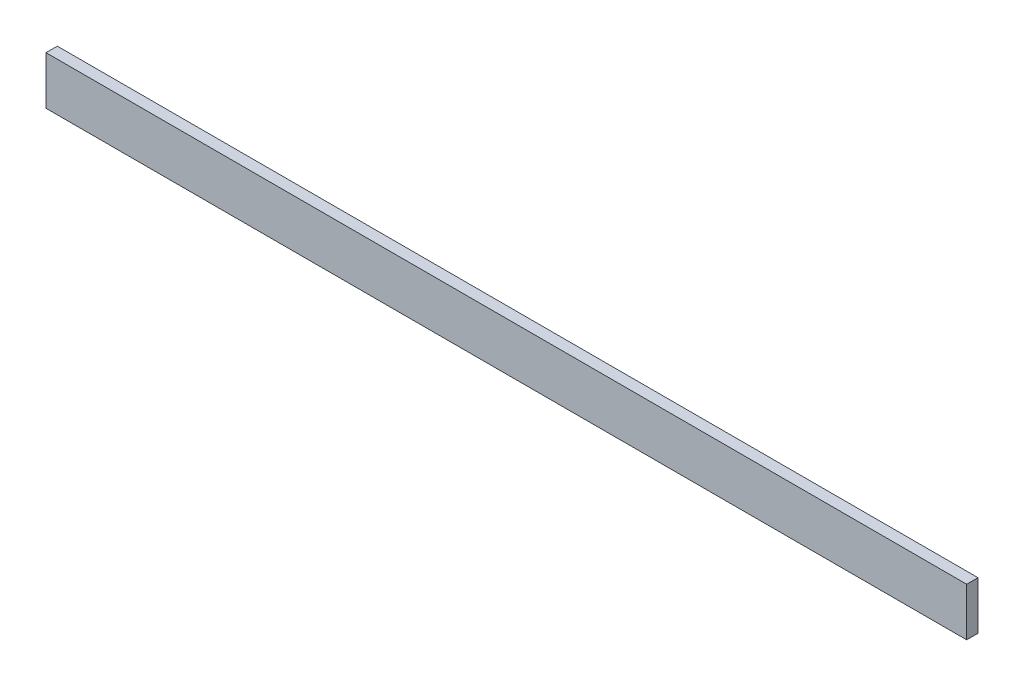
ISO-10303-21;
HEADER;
FILE_DESCRIPTION(('STEP AP214'),'2;1');
FILE_NAME('part.step','',(''),(''),'','','');
FILE_SCHEMA(('AUTOMOTIVE_DESIGN { 1 0 10303 214 1 1 1 1 }'));
ENDSEC;
DATA;
#1=APPLICATION_CONTEXT('core data for automotive mechanical design processes');
#2=APPLICATION_PROTOCOL_DEFINITION('international standard','automotive_design',2000,#1);
#3=PRODUCT_CONTEXT('',#1,'mechanical');
#4=PRODUCT('Part','Part','',(#3));
#5=PRODUCT_RELATED_PRODUCT_CATEGORY('part','',(#4));
#6=PRODUCT_DEFINITION_FORMATION('','',#4);
#7=PRODUCT_DEFINITION_CONTEXT('part definition',#1,'design');
#8=PRODUCT_DEFINITION('design','',#6,#7);
#9=PRODUCT_DEFINITION_SHAPE('','',#8);
#10=(LENGTH_UNIT() NAMED_UNIT(*) SI_UNIT(.MILLI.,.METRE.));
#11=(NAMED_UNIT(*) PLANE_ANGLE_UNIT() SI_UNIT($,.RADIAN.));
#12=(NAMED_UNIT(*) SI_UNIT($,.STERADIAN.) SOLID_ANGLE_UNIT());
#13=UNCERTAINTY_MEASURE_WITH_UNIT(LENGTH_MEASURE(1.E-05),#10,'distance_accuracy_value','');
#14=(GEOMETRIC_REPRESENTATION_CONTEXT(3) GLOBAL_UNCERTAINTY_ASSIGNED_CONTEXT((#13)) GLOBAL_UNIT_ASSIGNED_CONTEXT((#10,
#11,#12)) REPRESENTATION_CONTEXT('',''));
#15=CARTESIAN_POINT('',(0.,0.,0.));
#16=DIRECTION('',(0.,0.,1.));
#17=DIRECTION('',(1.,0.,0.));
#18=AXIS2_PLACEMENT_3D('',#15,#16,#17);
#19=CARTESIAN_POINT('',(485.394,-25.4,11.938));
#20=DIRECTION('',(-1.,0.,0.));
#21=DIRECTION('',(0.,0.,1.));
#22=AXIS2_PLACEMENT_3D('',#19,#20,#21);
#23=PLANE('',#22);
#24=DIRECTION('',(0.,1.,0.));
#25=VECTOR('',#24,1.);
#26=CARTESIAN_POINT('',(485.394,-25.4,0.));
#27=LINE('',#26,#25);
#28=CARTESIAN_POINT('',(485.394,-25.4,0.));
#29=VERTEX_POINT('',#28);
#30=CARTESIAN_POINT('',(485.394,25.4,0.));
#31=VERTEX_POINT('',#30);
#32=EDGE_CURVE('E96',#29,#31,#27,.T.);
#33=ORIENTED_EDGE('',*,*,#32,.T.);
#34=DIRECTION('',(0.,0.,-1.));
#35=VECTOR('',#34,1.);
#36=CARTESIAN_POINT('',(485.394,25.4,11.938));
#37=LINE('',#36,#35);
#38=CARTESIAN_POINT('',(485.394,25.4,11.938));
#39=VERTEX_POINT('',#38);
#40=EDGE_CURVE('E11',#39,#31,#37,.T.);
#41=ORIENTED_EDGE('',*,*,#40,.F.);
#42=DIRECTION('',(0.,1.,0.));
#43=VECTOR('',#42,1.);
#44=CARTESIAN_POINT('',(485.394,-25.4,11.938));
#45=LINE('',#44,#43);
#46=CARTESIAN_POINT('',(485.394,-25.4,11.938));
#47=VERTEX_POINT('',#46);
#48=EDGE_CURVE('E84',#47,#39,#45,.T.);
#49=ORIENTED_EDGE('',*,*,#48,.F.);
#50=DIRECTION('',(0.,0.,-1.));
#51=VECTOR('',#50,1.);
#52=CARTESIAN_POINT('',(485.394,-25.4,11.938));
#53=LINE('',#52,#51);
#54=EDGE_CURVE('E92',#47,#29,#53,.T.);
#55=ORIENTED_EDGE('',*,*,#54,.T.);
#56=EDGE_LOOP('',(#33,#41,#49,#55));
#57=FACE_BOUND('',#56,.T.);
#58=ADVANCED_FACE('F33',(#57),#23,.F.);
#59=CARTESIAN_POINT('',(-485.394,25.4,11.938));
#60=DIRECTION('',(0.,-1.,0.));
#61=DIRECTION('',(0.,0.,-1.));
#62=AXIS2_PLACEMENT_3D('',#59,#60,#61);
#63=PLANE('',#62);
#64=DIRECTION('',(-1.,0.,0.));
#65=VECTOR('',#64,1.);
#66=CARTESIAN_POINT('',(-485.394,25.4,0.));
#67=LINE('',#66,#65);
#68=CARTESIAN_POINT('',(-485.394,25.4,0.));
#69=VERTEX_POINT('',#68);
#70=EDGE_CURVE('E88',#31,#69,#67,.T.);
#71=ORIENTED_EDGE('',*,*,#70,.T.);
#72=DIRECTION('',(0.,0.,-1.));
#73=VECTOR('',#72,1.);
#74=CARTESIAN_POINT('',(-485.394,25.4,11.938));
#75=LINE('',#74,#73);
#76=CARTESIAN_POINT('',(-485.394,25.4,11.938));
#77=VERTEX_POINT('',#76);
#78=EDGE_CURVE('E41',#77,#69,#75,.T.);
#79=ORIENTED_EDGE('',*,*,#78,.F.);
#80=DIRECTION('',(-1.,0.,0.));
#81=VECTOR('',#80,1.);
#82=CARTESIAN_POINT('',(-485.394,25.4,11.938));
#83=LINE('',#82,#81);
#84=EDGE_CURVE('E79',#39,#77,#83,.T.);
#85=ORIENTED_EDGE('',*,*,#84,.F.);
#86=ORIENTED_EDGE('',*,*,#40,.T.);
#87=EDGE_LOOP('',(#71,#79,#85,#86));
#88=FACE_BOUND('',#87,.T.);
#89=ADVANCED_FACE('F87',(#88),#63,.F.);
#90=CARTESIAN_POINT('',(-485.394,-25.4,11.938));
#91=DIRECTION('',(1.,0.,0.));
#92=DIRECTION('',(0.,0.,-1.));
#93=AXIS2_PLACEMENT_3D('',#90,#91,#92);
#94=PLANE('',#93);
#95=DIRECTION('',(0.,-1.,0.));
#96=VECTOR('',#95,1.);
#97=CARTESIAN_POINT('',(-485.394,-25.4,0.));
#98=LINE('',#97,#96);
#99=CARTESIAN_POINT('',(-485.394,-25.4,0.));
#100=VERTEX_POINT('',#99);
#101=EDGE_CURVE('E66',#69,#100,#98,.T.);
#102=ORIENTED_EDGE('',*,*,#101,.T.);
#103=DIRECTION('',(0.,0.,-1.));
#104=VECTOR('',#103,1.);
#105=CARTESIAN_POINT('',(-485.394,-25.4,11.938));
#106=LINE('',#105,#104);
#107=CARTESIAN_POINT('',(-485.394,-25.4,11.938));
#108=VERTEX_POINT('',#107);
#109=EDGE_CURVE('E89',#108,#100,#106,.T.);
#110=ORIENTED_EDGE('',*,*,#109,.F.);
#111=DIRECTION('',(0.,-1.,0.));
#112=VECTOR('',#111,1.);
#113=CARTESIAN_POINT('',(-485.394,-25.4,11.938));
#114=LINE('',#113,#112);
#115=EDGE_CURVE('E82',#77,#108,#114,.T.);
#116=ORIENTED_EDGE('',*,*,#115,.F.);
#117=ORIENTED_EDGE('',*,*,#78,.T.);
#118=EDGE_LOOP('',(#102,#110,#116,#117));
#119=FACE_BOUND('',#118,.T.);
#120=ADVANCED_FACE('F90',(#119),#94,.F.);
#121=CARTESIAN_POINT('',(-485.394,-25.4,11.938));
#122=DIRECTION('',(0.,1.,0.));
#123=DIRECTION('',(0.,0.,1.));
#124=AXIS2_PLACEMENT_3D('',#121,#122,#123);
#125=PLANE('',#124);
#126=DIRECTION('',(1.,0.,0.));
#127=VECTOR('',#126,1.);
#128=CARTESIAN_POINT('',(-485.394,-25.4,0.));
#129=LINE('',#128,#127);
#130=EDGE_CURVE('E72',#100,#29,#129,.T.);
#131=ORIENTED_EDGE('',*,*,#130,.T.);
#132=ORIENTED_EDGE('',*,*,#54,.F.);
#133=DIRECTION('',(1.,0.,0.));
#134=VECTOR('',#133,1.);
#135=CARTESIAN_POINT('',(-485.394,-25.4,11.938));
#136=LINE('',#135,#134);
#137=EDGE_CURVE('E49',#108,#47,#136,.T.);
#138=ORIENTED_EDGE('',*,*,#137,.F.);
#139=ORIENTED_EDGE('',*,*,#109,.T.);
#140=EDGE_LOOP('',(#131,#132,#138,#139));
#141=FACE_BOUND('',#140,.T.);
#142=ADVANCED_FACE('F103',(#141),#125,.F.);
#143=CARTESIAN_POINT('',(0.,0.,11.938));
#144=DIRECTION('',(0.,0.,-1.));
#145=DIRECTION('',(-1.,0.,0.));
#146=AXIS2_PLACEMENT_3D('',#143,#144,#145);
#147=PLANE('',#146);
#148=ORIENTED_EDGE('',*,*,#48,.T.);
#149=ORIENTED_EDGE('',*,*,#84,.T.);
#150=ORIENTED_EDGE('',*,*,#115,.T.);
#151=ORIENTED_EDGE('',*,*,#137,.T.);
#152=EDGE_LOOP('',(#148,#149,#150,#151));
#153=FACE_BOUND('',#152,.T.);
#154=ADVANCED_FACE('F80',(#153),#147,.F.);
#155=CARTESIAN_POINT('',(0.,0.,0.));
#156=DIRECTION('',(0.,0.,-1.));
#157=DIRECTION('',(-1.,0.,0.));
#158=AXIS2_PLACEMENT_3D('',#155,#156,#157);
#159=PLANE('',#158);
#160=ORIENTED_EDGE('',*,*,#32,.F.);
#161=ORIENTED_EDGE('',*,*,#130,.F.);
#162=ORIENTED_EDGE('',*,*,#101,.F.);
#163=ORIENTED_EDGE('',*,*,#70,.F.);
#164=EDGE_LOOP('',(#160,#161,#162,#163));
#165=FACE_BOUND('',#164,.T.);
#166=ADVANCED_FACE('F106',(#165),#159,.T.);
#167=CLOSED_SHELL('',(#58,#89,#120,#142,#154,#166));
#168=MANIFOLD_SOLID_BREP('B2',#167);
#169=ADVANCED_BREP_SHAPE_REPRESENTATION('',(#18,#168),#14);
#170=SHAPE_DEFINITION_REPRESENTATION(#9,#169);
ENDSEC;
END-ISO-10303-21;
